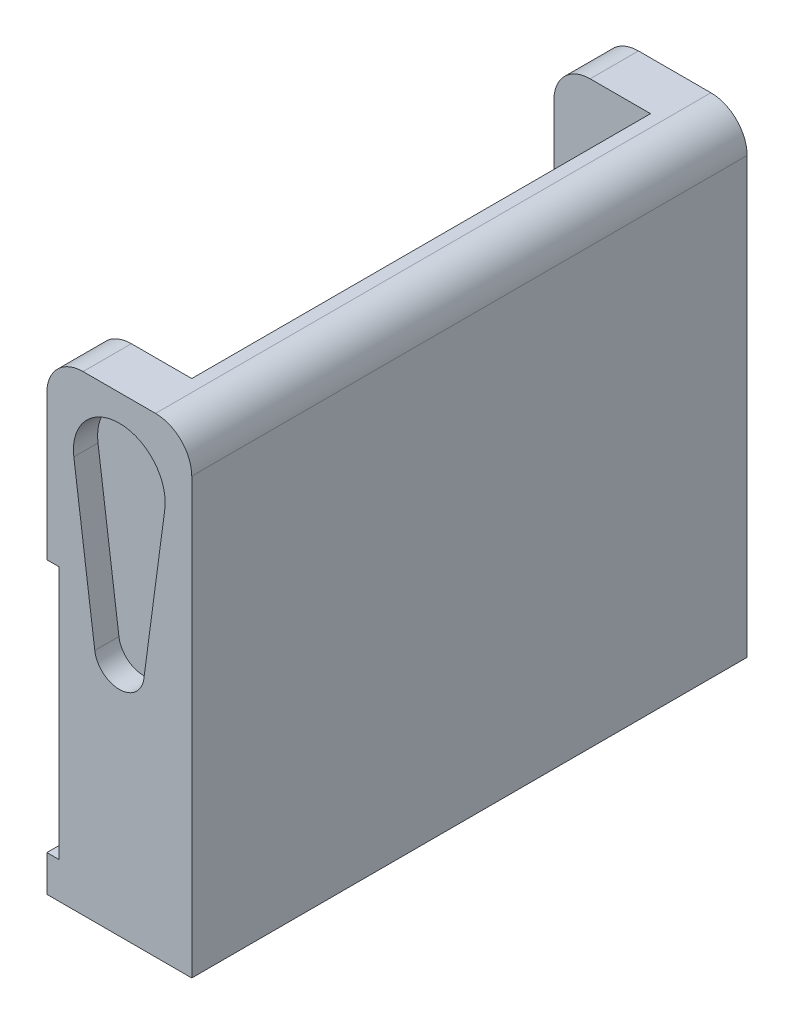
ISO-10303-21;
HEADER;
FILE_DESCRIPTION(('STEP AP214'),'2;1');
FILE_NAME('part.step','',(''),(''),'','','');
FILE_SCHEMA(('AUTOMOTIVE_DESIGN { 1 0 10303 214 1 1 1 1 }'));
ENDSEC;
DATA;
#1=APPLICATION_CONTEXT('core data for automotive mechanical design processes');
#2=APPLICATION_PROTOCOL_DEFINITION('international standard','automotive_design',2000,#1);
#3=PRODUCT_CONTEXT('',#1,'mechanical');
#4=PRODUCT('Part','Part','',(#3));
#5=PRODUCT_RELATED_PRODUCT_CATEGORY('part','',(#4));
#6=PRODUCT_DEFINITION_FORMATION('','',#4);
#7=PRODUCT_DEFINITION_CONTEXT('part definition',#1,'design');
#8=PRODUCT_DEFINITION('design','',#6,#7);
#9=PRODUCT_DEFINITION_SHAPE('','',#8);
#10=(LENGTH_UNIT() NAMED_UNIT(*) SI_UNIT(.MILLI.,.METRE.));
#11=(NAMED_UNIT(*) PLANE_ANGLE_UNIT() SI_UNIT($,.RADIAN.));
#12=(NAMED_UNIT(*) SI_UNIT($,.STERADIAN.) SOLID_ANGLE_UNIT());
#13=UNCERTAINTY_MEASURE_WITH_UNIT(LENGTH_MEASURE(1.E-05),#10,'distance_accuracy_value','');
#14=(GEOMETRIC_REPRESENTATION_CONTEXT(3) GLOBAL_UNCERTAINTY_ASSIGNED_CONTEXT((#13)) GLOBAL_UNIT_ASSIGNED_CONTEXT((#10,
#11,#12)) REPRESENTATION_CONTEXT('',''));
#15=CARTESIAN_POINT('',(0.,0.,0.));
#16=DIRECTION('',(0.,0.,1.));
#17=DIRECTION('',(1.,0.,0.));
#18=AXIS2_PLACEMENT_3D('',#15,#16,#17);
#19=CARTESIAN_POINT('',(-6.,-33.,-19.));
#20=DIRECTION('',(-1.,0.,0.));
#21=DIRECTION('',(0.,0.,1.));
#22=AXIS2_PLACEMENT_3D('',#19,#20,#21);
#23=PLANE('',#22);
#24=DIRECTION('',(0.,0.,-1.));
#25=VECTOR('',#24,1.);
#26=CARTESIAN_POINT('',(-6.,-9.,-23.));
#27=LINE('',#26,#25);
#28=CARTESIAN_POINT('',(-6.,-9.,-19.));
#29=VERTEX_POINT('',#28);
#30=CARTESIAN_POINT('',(-6.,-9.,-23.));
#31=VERTEX_POINT('',#30);
#32=EDGE_CURVE('E417',#29,#31,#27,.T.);
#33=ORIENTED_EDGE('',*,*,#32,.F.);
#34=DIRECTION('',(0.,1.,0.));
#35=VECTOR('',#34,1.);
#36=CARTESIAN_POINT('',(-6.,-33.,-19.));
#37=LINE('',#36,#35);
#38=CARTESIAN_POINT('',(-6.,3.,-19.));
#39=VERTEX_POINT('',#38);
#40=EDGE_CURVE('E336',#29,#39,#37,.T.);
#41=ORIENTED_EDGE('',*,*,#40,.T.);
#42=DIRECTION('',(0.,0.,1.));
#43=VECTOR('',#42,1.);
#44=CARTESIAN_POINT('',(-6.,3.,-23.));
#45=LINE('',#44,#43);
#46=CARTESIAN_POINT('',(-6.,3.,-23.));
#47=VERTEX_POINT('',#46);
#48=EDGE_CURVE('E385',#39,#47,#45,.F.);
#49=ORIENTED_EDGE('',*,*,#48,.T.);
#50=DIRECTION('',(0.,1.,0.));
#51=VECTOR('',#50,1.);
#52=CARTESIAN_POINT('',(-6.,-33.,-23.));
#53=LINE('',#52,#51);
#54=EDGE_CURVE('E351',#31,#47,#53,.T.);
#55=ORIENTED_EDGE('',*,*,#54,.F.);
#56=EDGE_LOOP('',(#33,#41,#49,#55));
#57=FACE_BOUND('',#56,.T.);
#58=ADVANCED_FACE('F33',(#57),#23,.T.);
#59=CARTESIAN_POINT('',(-6.,-33.,23.));
#60=DIRECTION('',(-1.,0.,0.));
#61=DIRECTION('',(0.,0.,1.));
#62=AXIS2_PLACEMENT_3D('',#59,#60,#61);
#63=PLANE('',#62);
#64=CARTESIAN_POINT('',(-6.,-9.,23.));
#65=VERTEX_POINT('',#64);
#66=CARTESIAN_POINT('',(-6.,-9.,19.));
#67=VERTEX_POINT('',#66);
#68=EDGE_CURVE('E226',#65,#67,#27,.T.);
#69=ORIENTED_EDGE('',*,*,#68,.F.);
#70=DIRECTION('',(0.,1.,0.));
#71=VECTOR('',#70,1.);
#72=CARTESIAN_POINT('',(-6.,-33.,23.));
#73=LINE('',#72,#71);
#74=CARTESIAN_POINT('',(-6.,3.,23.));
#75=VERTEX_POINT('',#74);
#76=EDGE_CURVE('E361',#65,#75,#73,.T.);
#77=ORIENTED_EDGE('',*,*,#76,.T.);
#78=DIRECTION('',(0.,0.,1.));
#79=VECTOR('',#78,1.);
#80=CARTESIAN_POINT('',(-6.,3.,19.));
#81=LINE('',#80,#79);
#82=CARTESIAN_POINT('',(-6.,3.,19.));
#83=VERTEX_POINT('',#82);
#84=EDGE_CURVE('E399',#75,#83,#81,.F.);
#85=ORIENTED_EDGE('',*,*,#84,.T.);
#86=DIRECTION('',(0.,1.,0.));
#87=VECTOR('',#86,1.);
#88=CARTESIAN_POINT('',(-6.,-33.,19.));
#89=LINE('',#88,#87);
#90=EDGE_CURVE('E365',#67,#83,#89,.T.);
#91=ORIENTED_EDGE('',*,*,#90,.F.);
#92=EDGE_LOOP('',(#69,#77,#85,#91));
#93=FACE_BOUND('',#92,.T.);
#94=ADVANCED_FACE('F433',(#93),#63,.T.);
#95=CARTESIAN_POINT('',(-6.,-33.,-23.));
#96=DIRECTION('',(0.,0.,-1.));
#97=DIRECTION('',(-1.,0.,0.));
#98=AXIS2_PLACEMENT_3D('',#95,#96,#97);
#99=PLANE('',#98);
#100=DIRECTION('',(-1.,0.,0.));
#101=VECTOR('',#100,1.);
#102=CARTESIAN_POINT('',(-5.,-9.,-23.));
#103=LINE('',#102,#101);
#104=CARTESIAN_POINT('',(-5.,-9.,-23.));
#105=VERTEX_POINT('',#104);
#106=EDGE_CURVE('E244',#105,#31,#103,.T.);
#107=ORIENTED_EDGE('',*,*,#106,.T.);
#108=ORIENTED_EDGE('',*,*,#54,.T.);
#109=CARTESIAN_POINT('',(-3.,3.,-23.));
#110=DIRECTION('',(0.,0.,-1.));
#111=DIRECTION('',(-1.,0.,0.));
#112=AXIS2_PLACEMENT_3D('',#109,#110,#111);
#113=CIRCLE('',#112,3.);
#114=CARTESIAN_POINT('',(-3.,6.,-23.));
#115=VERTEX_POINT('',#114);
#116=EDGE_CURVE('E390',#47,#115,#113,.T.);
#117=ORIENTED_EDGE('',*,*,#116,.T.);
#118=DIRECTION('',(-1.,0.,0.));
#119=VECTOR('',#118,1.);
#120=CARTESIAN_POINT('',(-6.,6.,-23.));
#121=LINE('',#120,#119);
#122=CARTESIAN_POINT('',(3.,6.,-23.));
#123=VERTEX_POINT('',#122);
#124=EDGE_CURVE('E316',#123,#115,#121,.T.);
#125=ORIENTED_EDGE('',*,*,#124,.F.);
#126=CARTESIAN_POINT('',(3.,3.,-23.));
#127=DIRECTION('',(0.,0.,-1.));
#128=DIRECTION('',(-1.,0.,0.));
#129=AXIS2_PLACEMENT_3D('',#126,#127,#128);
#130=CIRCLE('',#129,3.);
#131=CARTESIAN_POINT('',(6.,3.,-23.));
#132=VERTEX_POINT('',#131);
#133=EDGE_CURVE('E388',#123,#132,#130,.T.);
#134=ORIENTED_EDGE('',*,*,#133,.T.);
#135=DIRECTION('',(0.,1.,0.));
#136=VECTOR('',#135,1.);
#137=CARTESIAN_POINT('',(6.,-33.,-23.));
#138=LINE('',#137,#136);
#139=CARTESIAN_POINT('',(6.,-33.,-23.));
#140=VERTEX_POINT('',#139);
#141=EDGE_CURVE('E352',#140,#132,#138,.T.);
#142=ORIENTED_EDGE('',*,*,#141,.F.);
#143=DIRECTION('',(-1.,0.,0.));
#144=VECTOR('',#143,1.);
#145=CARTESIAN_POINT('',(-6.,-33.,-23.));
#146=LINE('',#145,#144);
#147=CARTESIAN_POINT('',(-6.,-33.,-23.));
#148=VERTEX_POINT('',#147);
#149=EDGE_CURVE('E334',#140,#148,#146,.T.);
#150=ORIENTED_EDGE('',*,*,#149,.T.);
#151=CARTESIAN_POINT('',(-6.,-30.,-23.));
#152=VERTEX_POINT('',#151);
#153=EDGE_CURVE('E232',#148,#152,#53,.T.);
#154=ORIENTED_EDGE('',*,*,#153,.T.);
#155=DIRECTION('',(-1.,0.,0.));
#156=VECTOR('',#155,1.);
#157=CARTESIAN_POINT('',(-5.,-30.,-23.));
#158=LINE('',#157,#156);
#159=CARTESIAN_POINT('',(-5.,-30.,-23.));
#160=VERTEX_POINT('',#159);
#161=EDGE_CURVE('E211',#160,#152,#158,.T.);
#162=ORIENTED_EDGE('',*,*,#161,.F.);
#163=DIRECTION('',(0.,-1.,0.));
#164=VECTOR('',#163,1.);
#165=CARTESIAN_POINT('',(-5.,-30.,-23.));
#166=LINE('',#165,#164);
#167=EDGE_CURVE('E219',#105,#160,#166,.T.);
#168=ORIENTED_EDGE('',*,*,#167,.F.);
#169=EDGE_LOOP('',(#107,#108,#117,#125,#134,#142,#150,#154,#162,#168));
#170=FACE_BOUND('',#169,.T.);
#171=DIRECTION('',(0.132075471698113,0.991239663136883,0.));
#172=VECTOR('',#171,1.);
#173=CARTESIAN_POINT('',(3.76671071992015,-0.501886792452829,-23.));
#174=LINE('',#173,#172);
#175=CARTESIAN_POINT('',(2.03204130943061,-13.5207547169811,-23.));
#176=VERTEX_POINT('',#175);
#177=CARTESIAN_POINT('',(3.76671071992015,-0.501886792452826,-23.));
#178=VERTEX_POINT('',#177);
#179=EDGE_CURVE('E262',#176,#178,#174,.T.);
#180=ORIENTED_EDGE('',*,*,#179,.T.);
#181=CARTESIAN_POINT('',(0.,0.,-23.));
#182=DIRECTION('',(0.,0.,1.));
#183=DIRECTION('',(1.,0.,0.));
#184=AXIS2_PLACEMENT_3D('',#181,#182,#183);
#185=CIRCLE('',#184,3.8);
#186=CARTESIAN_POINT('',(-3.76671071992015,-0.50188679245283,-23.));
#187=VERTEX_POINT('',#186);
#188=EDGE_CURVE('E248',#178,#187,#185,.T.);
#189=ORIENTED_EDGE('',*,*,#188,.T.);
#190=DIRECTION('',(0.132075471698113,-0.991239663136883,0.));
#191=VECTOR('',#190,1.);
#192=CARTESIAN_POINT('',(-3.76671071992015,-0.50188679245283,-23.));
#193=LINE('',#192,#191);
#194=CARTESIAN_POINT('',(-2.03204130943061,-13.5207547169811,-23.));
#195=VERTEX_POINT('',#194);
#196=EDGE_CURVE('E253',#187,#195,#193,.T.);
#197=ORIENTED_EDGE('',*,*,#196,.T.);
#198=CARTESIAN_POINT('',(0.,-13.25,-23.));
#199=DIRECTION('',(0.,0.,1.));
#200=DIRECTION('',(1.,0.,0.));
#201=AXIS2_PLACEMENT_3D('',#198,#199,#200);
#202=CIRCLE('',#201,2.05);
#203=EDGE_CURVE('E265',#195,#176,#202,.T.);
#204=ORIENTED_EDGE('',*,*,#203,.T.);
#205=EDGE_LOOP('',(#180,#189,#197,#204));
#206=FACE_BOUND('',#205,.T.);
#207=ADVANCED_FACE('F229',(#170,#206),#99,.T.);
#208=DIRECTION('',(0.,0.,1.));
#209=VECTOR('',#208,1.);
#210=CARTESIAN_POINT('',(-6.,-30.,-23.));
#211=LINE('',#210,#209);
#212=CARTESIAN_POINT('',(-6.,-30.,-19.));
#213=VERTEX_POINT('',#212);
#214=EDGE_CURVE('E418',#152,#213,#211,.T.);
#215=ORIENTED_EDGE('',*,*,#214,.F.);
#216=ORIENTED_EDGE('',*,*,#153,.F.);
#217=DIRECTION('',(0.,0.,1.));
#218=VECTOR('',#217,1.);
#219=CARTESIAN_POINT('',(-6.,-33.,-19.));
#220=LINE('',#219,#218);
#221=CARTESIAN_POINT('',(-6.,-33.,-19.));
#222=VERTEX_POINT('',#221);
#223=EDGE_CURVE('E312',#148,#222,#220,.T.);
#224=ORIENTED_EDGE('',*,*,#223,.T.);
#225=EDGE_CURVE('E371',#222,#213,#37,.T.);
#226=ORIENTED_EDGE('',*,*,#225,.T.);
#227=EDGE_LOOP('',(#215,#216,#224,#226));
#228=FACE_BOUND('',#227,.T.);
#229=ADVANCED_FACE('F481',(#228),#23,.T.);
#230=CARTESIAN_POINT('',(6.,-33.,-23.));
#231=DIRECTION('',(1.,0.,0.));
#232=DIRECTION('',(0.,0.,-1.));
#233=AXIS2_PLACEMENT_3D('',#230,#231,#232);
#234=PLANE('',#233);
#235=ORIENTED_EDGE('',*,*,#141,.T.);
#236=DIRECTION('',(0.,0.,-1.));
#237=VECTOR('',#236,1.);
#238=CARTESIAN_POINT('',(6.,3.,23.));
#239=LINE('',#238,#237);
#240=CARTESIAN_POINT('',(6.,3.,23.));
#241=VERTEX_POINT('',#240);
#242=EDGE_CURVE('E392',#132,#241,#239,.F.);
#243=ORIENTED_EDGE('',*,*,#242,.T.);
#244=DIRECTION('',(0.,1.,0.));
#245=VECTOR('',#244,1.);
#246=CARTESIAN_POINT('',(6.,-33.,23.));
#247=LINE('',#246,#245);
#248=CARTESIAN_POINT('',(6.,-33.,23.));
#249=VERTEX_POINT('',#248);
#250=EDGE_CURVE('E355',#249,#241,#247,.T.);
#251=ORIENTED_EDGE('',*,*,#250,.F.);
#252=DIRECTION('',(0.,0.,-1.));
#253=VECTOR('',#252,1.);
#254=CARTESIAN_POINT('',(6.,-33.,-23.));
#255=LINE('',#254,#253);
#256=EDGE_CURVE('E331',#249,#140,#255,.T.);
#257=ORIENTED_EDGE('',*,*,#256,.T.);
#258=EDGE_LOOP('',(#235,#243,#251,#257));
#259=FACE_BOUND('',#258,.T.);
#260=ADVANCED_FACE('F483',(#259),#234,.T.);
#261=CARTESIAN_POINT('',(6.,-33.,23.));
#262=DIRECTION('',(0.,0.,1.));
#263=DIRECTION('',(1.,0.,0.));
#264=AXIS2_PLACEMENT_3D('',#261,#262,#263);
#265=PLANE('',#264);
#266=DIRECTION('',(-1.,0.,0.));
#267=VECTOR('',#266,1.);
#268=CARTESIAN_POINT('',(-5.,-9.,23.));
#269=LINE('',#268,#267);
#270=CARTESIAN_POINT('',(-5.,-9.,23.));
#271=VERTEX_POINT('',#270);
#272=EDGE_CURVE('E236',#271,#65,#269,.T.);
#273=ORIENTED_EDGE('',*,*,#272,.F.);
#274=DIRECTION('',(0.,1.,0.));
#275=VECTOR('',#274,1.);
#276=CARTESIAN_POINT('',(-5.,-30.,23.));
#277=LINE('',#276,#275);
#278=CARTESIAN_POINT('',(-5.,-30.,23.));
#279=VERTEX_POINT('',#278);
#280=EDGE_CURVE('E215',#279,#271,#277,.T.);
#281=ORIENTED_EDGE('',*,*,#280,.F.);
#282=DIRECTION('',(-1.,0.,0.));
#283=VECTOR('',#282,1.);
#284=CARTESIAN_POINT('',(-5.,-30.,23.));
#285=LINE('',#284,#283);
#286=CARTESIAN_POINT('',(-6.,-30.,23.));
#287=VERTEX_POINT('',#286);
#288=EDGE_CURVE('E233',#279,#287,#285,.T.);
#289=ORIENTED_EDGE('',*,*,#288,.T.);
#290=CARTESIAN_POINT('',(-6.,-33.,23.));
#291=VERTEX_POINT('',#290);
#292=EDGE_CURVE('E358',#291,#287,#73,.T.);
#293=ORIENTED_EDGE('',*,*,#292,.F.);
#294=DIRECTION('',(1.,0.,0.));
#295=VECTOR('',#294,1.);
#296=CARTESIAN_POINT('',(6.,-33.,23.));
#297=LINE('',#296,#295);
#298=EDGE_CURVE('E328',#291,#249,#297,.T.);
#299=ORIENTED_EDGE('',*,*,#298,.T.);
#300=ORIENTED_EDGE('',*,*,#250,.T.);
#301=CARTESIAN_POINT('',(3.,3.,23.));
#302=DIRECTION('',(0.,0.,1.));
#303=DIRECTION('',(1.,0.,0.));
#304=AXIS2_PLACEMENT_3D('',#301,#302,#303);
#305=CIRCLE('',#304,3.);
#306=CARTESIAN_POINT('',(3.,6.,23.));
#307=VERTEX_POINT('',#306);
#308=EDGE_CURVE('E397',#241,#307,#305,.T.);
#309=ORIENTED_EDGE('',*,*,#308,.T.);
#310=DIRECTION('',(1.,0.,0.));
#311=VECTOR('',#310,1.);
#312=CARTESIAN_POINT('',(6.,6.,23.));
#313=LINE('',#312,#311);
#314=CARTESIAN_POINT('',(-3.,6.,23.));
#315=VERTEX_POINT('',#314);
#316=EDGE_CURVE('E344',#315,#307,#313,.T.);
#317=ORIENTED_EDGE('',*,*,#316,.F.);
#318=CARTESIAN_POINT('',(-3.,3.,23.));
#319=DIRECTION('',(0.,0.,1.));
#320=DIRECTION('',(1.,0.,0.));
#321=AXIS2_PLACEMENT_3D('',#318,#319,#320);
#322=CIRCLE('',#321,3.);
#323=EDGE_CURVE('E394',#315,#75,#322,.T.);
#324=ORIENTED_EDGE('',*,*,#323,.T.);
#325=ORIENTED_EDGE('',*,*,#76,.F.);
#326=EDGE_LOOP('',(#273,#281,#289,#293,#299,#300,#309,#317,#324,#325));
#327=FACE_BOUND('',#326,.T.);
#328=CARTESIAN_POINT('',(0.,0.,23.));
#329=DIRECTION('',(0.,0.,1.));
#330=DIRECTION('',(1.,0.,0.));
#331=AXIS2_PLACEMENT_3D('',#328,#329,#330);
#332=CIRCLE('',#331,3.8);
#333=CARTESIAN_POINT('',(3.76671071992015,-0.501886792452829,23.));
#334=VERTEX_POINT('',#333);
#335=CARTESIAN_POINT('',(-3.76671071992015,-0.501886792452826,23.));
#336=VERTEX_POINT('',#335);
#337=EDGE_CURVE('E273',#334,#336,#332,.T.);
#338=ORIENTED_EDGE('',*,*,#337,.F.);
#339=DIRECTION('',(0.132075471698113,0.991239663136883,0.));
#340=VECTOR('',#339,1.);
#341=CARTESIAN_POINT('',(3.76671071992015,-0.501886792452829,23.));
#342=LINE('',#341,#340);
#343=CARTESIAN_POINT('',(2.03204130943061,-13.5207547169811,23.));
#344=VERTEX_POINT('',#343);
#345=EDGE_CURVE('E284',#344,#334,#342,.T.);
#346=ORIENTED_EDGE('',*,*,#345,.F.);
#347=CARTESIAN_POINT('',(0.,-13.25,23.));
#348=DIRECTION('',(0.,0.,1.));
#349=DIRECTION('',(1.,0.,0.));
#350=AXIS2_PLACEMENT_3D('',#347,#348,#349);
#351=CIRCLE('',#350,2.05);
#352=CARTESIAN_POINT('',(-2.03204130943061,-13.5207547169811,23.));
#353=VERTEX_POINT('',#352);
#354=EDGE_CURVE('E298',#353,#344,#351,.T.);
#355=ORIENTED_EDGE('',*,*,#354,.F.);
#356=DIRECTION('',(0.132075471698113,-0.991239663136883,0.));
#357=VECTOR('',#356,1.);
#358=CARTESIAN_POINT('',(-3.76671071992015,-0.50188679245283,23.));
#359=LINE('',#358,#357);
#360=EDGE_CURVE('E295',#336,#353,#359,.T.);
#361=ORIENTED_EDGE('',*,*,#360,.F.);
#362=EDGE_LOOP('',(#338,#346,#355,#361));
#363=FACE_BOUND('',#362,.T.);
#364=ADVANCED_FACE('F434',(#327,#363),#265,.T.);
#365=CARTESIAN_POINT('',(-6.,-30.,19.));
#366=VERTEX_POINT('',#365);
#367=EDGE_CURVE('E420',#366,#287,#211,.T.);
#368=ORIENTED_EDGE('',*,*,#367,.F.);
#369=CARTESIAN_POINT('',(-6.,-33.,19.));
#370=VERTEX_POINT('',#369);
#371=EDGE_CURVE('E362',#370,#366,#89,.T.);
#372=ORIENTED_EDGE('',*,*,#371,.F.);
#373=DIRECTION('',(0.,0.,1.));
#374=VECTOR('',#373,1.);
#375=CARTESIAN_POINT('',(-6.,-33.,23.));
#376=LINE('',#375,#374);
#377=EDGE_CURVE('E325',#370,#291,#376,.T.);
#378=ORIENTED_EDGE('',*,*,#377,.T.);
#379=ORIENTED_EDGE('',*,*,#292,.T.);
#380=EDGE_LOOP('',(#368,#372,#378,#379));
#381=FACE_BOUND('',#380,.T.);
#382=ADVANCED_FACE('F460',(#381),#63,.T.);
#383=CARTESIAN_POINT('',(-6.,-33.,19.));
#384=DIRECTION('',(0.,0.,-1.));
#385=DIRECTION('',(-1.,0.,0.));
#386=AXIS2_PLACEMENT_3D('',#383,#384,#385);
#387=PLANE('',#386);
#388=DIRECTION('',(1.,0.,0.));
#389=VECTOR('',#388,1.);
#390=CARTESIAN_POINT('',(-6.,-9.,19.));
#391=LINE('',#390,#389);
#392=CARTESIAN_POINT('',(-5.,-9.,19.));
#393=VERTEX_POINT('',#392);
#394=EDGE_CURVE('E246',#67,#393,#391,.T.);
#395=ORIENTED_EDGE('',*,*,#394,.F.);
#396=ORIENTED_EDGE('',*,*,#90,.T.);
#397=CARTESIAN_POINT('',(-3.,3.,19.));
#398=DIRECTION('',(0.,0.,-1.));
#399=DIRECTION('',(-1.,0.,0.));
#400=AXIS2_PLACEMENT_3D('',#397,#398,#399);
#401=CIRCLE('',#400,3.);
#402=CARTESIAN_POINT('',(-3.,6.,19.));
#403=VERTEX_POINT('',#402);
#404=EDGE_CURVE('E402',#83,#403,#401,.T.);
#405=ORIENTED_EDGE('',*,*,#404,.T.);
#406=DIRECTION('',(-1.,0.,0.));
#407=VECTOR('',#406,1.);
#408=CARTESIAN_POINT('',(-6.,6.,19.));
#409=LINE('',#408,#407);
#410=CARTESIAN_POINT('',(2.00000000000001,6.,19.));
#411=VERTEX_POINT('',#410);
#412=EDGE_CURVE('E341',#411,#403,#409,.T.);
#413=ORIENTED_EDGE('',*,*,#412,.F.);
#414=DIRECTION('',(0.,1.,0.));
#415=VECTOR('',#414,1.);
#416=CARTESIAN_POINT('',(2.00000000000001,-33.,19.));
#417=LINE('',#416,#415);
#418=CARTESIAN_POINT('',(2.00000000000001,-33.,19.));
#419=VERTEX_POINT('',#418);
#420=EDGE_CURVE('E366',#419,#411,#417,.T.);
#421=ORIENTED_EDGE('',*,*,#420,.F.);
#422=DIRECTION('',(-1.,0.,0.));
#423=VECTOR('',#422,1.);
#424=CARTESIAN_POINT('',(-6.,-33.,19.));
#425=LINE('',#424,#423);
#426=EDGE_CURVE('E322',#419,#370,#425,.T.);
#427=ORIENTED_EDGE('',*,*,#426,.T.);
#428=ORIENTED_EDGE('',*,*,#371,.T.);
#429=DIRECTION('',(-1.,0.,0.));
#430=VECTOR('',#429,1.);
#431=CARTESIAN_POINT('',(-6.,-30.,19.));
#432=LINE('',#431,#430);
#433=CARTESIAN_POINT('',(-5.,-30.,19.));
#434=VERTEX_POINT('',#433);
#435=EDGE_CURVE('E243',#434,#366,#432,.T.);
#436=ORIENTED_EDGE('',*,*,#435,.F.);
#437=DIRECTION('',(0.,-1.,0.));
#438=VECTOR('',#437,1.);
#439=CARTESIAN_POINT('',(-5.,-33.,19.));
#440=LINE('',#439,#438);
#441=EDGE_CURVE('E241',#393,#434,#440,.T.);
#442=ORIENTED_EDGE('',*,*,#441,.F.);
#443=EDGE_LOOP('',(#395,#396,#405,#413,#421,#427,#428,#436,#442));
#444=FACE_BOUND('',#443,.T.);
#445=ADVANCED_FACE('F443',(#444),#387,.T.);
#446=CARTESIAN_POINT('',(2.00000000000001,-33.,-19.));
#447=DIRECTION('',(-1.,0.,0.));
#448=DIRECTION('',(0.,0.,1.));
#449=AXIS2_PLACEMENT_3D('',#446,#447,#448);
#450=PLANE('',#449);
#451=DIRECTION('',(0.,0.,1.));
#452=VECTOR('',#451,1.);
#453=CARTESIAN_POINT('',(2.00000000000001,6.,-19.));
#454=LINE('',#453,#452);
#455=CARTESIAN_POINT('',(2.00000000000001,6.,-19.));
#456=VERTEX_POINT('',#455);
#457=EDGE_CURVE('E338',#456,#411,#454,.T.);
#458=ORIENTED_EDGE('',*,*,#457,.F.);
#459=DIRECTION('',(0.,1.,0.));
#460=VECTOR('',#459,1.);
#461=CARTESIAN_POINT('',(2.00000000000001,-33.,-19.));
#462=LINE('',#461,#460);
#463=CARTESIAN_POINT('',(2.00000000000001,-33.,-19.));
#464=VERTEX_POINT('',#463);
#465=EDGE_CURVE('E368',#464,#456,#462,.T.);
#466=ORIENTED_EDGE('',*,*,#465,.F.);
#467=DIRECTION('',(0.,0.,1.));
#468=VECTOR('',#467,1.);
#469=CARTESIAN_POINT('',(2.00000000000001,-33.,-19.));
#470=LINE('',#469,#468);
#471=EDGE_CURVE('E319',#464,#419,#470,.T.);
#472=ORIENTED_EDGE('',*,*,#471,.T.);
#473=ORIENTED_EDGE('',*,*,#420,.T.);
#474=EDGE_LOOP('',(#458,#466,#472,#473));
#475=FACE_BOUND('',#474,.T.);
#476=ADVANCED_FACE('F448',(#475),#450,.T.);
#477=CARTESIAN_POINT('',(2.00000000000001,-33.,-19.));
#478=DIRECTION('',(0.,0.,1.));
#479=DIRECTION('',(1.,0.,0.));
#480=AXIS2_PLACEMENT_3D('',#477,#478,#479);
#481=PLANE('',#480);
#482=DIRECTION('',(-1.,0.,0.));
#483=VECTOR('',#482,1.);
#484=CARTESIAN_POINT('',(2.00000000000001,-9.,-19.));
#485=LINE('',#484,#483);
#486=CARTESIAN_POINT('',(-5.,-9.,-19.));
#487=VERTEX_POINT('',#486);
#488=EDGE_CURVE('E11',#487,#29,#485,.T.);
#489=ORIENTED_EDGE('',*,*,#488,.F.);
#490=DIRECTION('',(0.,1.,0.));
#491=VECTOR('',#490,1.);
#492=CARTESIAN_POINT('',(-5.,-33.,-19.));
#493=LINE('',#492,#491);
#494=CARTESIAN_POINT('',(-5.,-30.,-19.));
#495=VERTEX_POINT('',#494);
#496=EDGE_CURVE('E404',#495,#487,#493,.T.);
#497=ORIENTED_EDGE('',*,*,#496,.F.);
#498=DIRECTION('',(1.,0.,0.));
#499=VECTOR('',#498,1.);
#500=CARTESIAN_POINT('',(2.00000000000001,-30.,-19.));
#501=LINE('',#500,#499);
#502=EDGE_CURVE('E41',#213,#495,#501,.T.);
#503=ORIENTED_EDGE('',*,*,#502,.F.);
#504=ORIENTED_EDGE('',*,*,#225,.F.);
#505=DIRECTION('',(1.,0.,0.));
#506=VECTOR('',#505,1.);
#507=CARTESIAN_POINT('',(2.00000000000001,-33.,-19.));
#508=LINE('',#507,#506);
#509=EDGE_CURVE('E315',#222,#464,#508,.T.);
#510=ORIENTED_EDGE('',*,*,#509,.T.);
#511=ORIENTED_EDGE('',*,*,#465,.T.);
#512=DIRECTION('',(1.,0.,0.));
#513=VECTOR('',#512,1.);
#514=CARTESIAN_POINT('',(2.00000000000001,6.,-19.));
#515=LINE('',#514,#513);
#516=CARTESIAN_POINT('',(-3.,6.,-19.));
#517=VERTEX_POINT('',#516);
#518=EDGE_CURVE('E305',#517,#456,#515,.T.);
#519=ORIENTED_EDGE('',*,*,#518,.F.);
#520=CARTESIAN_POINT('',(-3.,3.,-19.));
#521=DIRECTION('',(0.,0.,1.));
#522=DIRECTION('',(1.,0.,0.));
#523=AXIS2_PLACEMENT_3D('',#520,#521,#522);
#524=CIRCLE('',#523,3.);
#525=EDGE_CURVE('E382',#517,#39,#524,.T.);
#526=ORIENTED_EDGE('',*,*,#525,.T.);
#527=ORIENTED_EDGE('',*,*,#40,.F.);
#528=EDGE_LOOP('',(#489,#497,#503,#504,#510,#511,#519,#526,#527));
#529=FACE_BOUND('',#528,.T.);
#530=ADVANCED_FACE('F411',(#529),#481,.T.);
#531=CARTESIAN_POINT('',(0.,-33.,0.));
#532=DIRECTION('',(0.,-1.,0.));
#533=DIRECTION('',(0.,0.,-1.));
#534=AXIS2_PLACEMENT_3D('',#531,#532,#533);
#535=PLANE('',#534);
#536=ORIENTED_EDGE('',*,*,#223,.F.);
#537=ORIENTED_EDGE('',*,*,#149,.F.);
#538=ORIENTED_EDGE('',*,*,#256,.F.);
#539=ORIENTED_EDGE('',*,*,#298,.F.);
#540=ORIENTED_EDGE('',*,*,#377,.F.);
#541=ORIENTED_EDGE('',*,*,#426,.F.);
#542=ORIENTED_EDGE('',*,*,#471,.F.);
#543=ORIENTED_EDGE('',*,*,#509,.F.);
#544=EDGE_LOOP('',(#536,#537,#538,#539,#540,#541,#542,#543));
#545=FACE_BOUND('',#544,.T.);
#546=ADVANCED_FACE('F454',(#545),#535,.T.);
#547=CARTESIAN_POINT('',(0.,6.,0.));
#548=DIRECTION('',(0.,-1.,0.));
#549=DIRECTION('',(0.,0.,-1.));
#550=AXIS2_PLACEMENT_3D('',#547,#548,#549);
#551=PLANE('',#550);
#552=ORIENTED_EDGE('',*,*,#124,.T.);
#553=DIRECTION('',(0.,0.,1.));
#554=VECTOR('',#553,1.);
#555=CARTESIAN_POINT('',(-3.,6.,-19.));
#556=LINE('',#555,#554);
#557=EDGE_CURVE('E379',#115,#517,#556,.T.);
#558=ORIENTED_EDGE('',*,*,#557,.T.);
#559=ORIENTED_EDGE('',*,*,#518,.T.);
#560=ORIENTED_EDGE('',*,*,#457,.T.);
#561=ORIENTED_EDGE('',*,*,#412,.T.);
#562=DIRECTION('',(0.,0.,1.));
#563=VECTOR('',#562,1.);
#564=CARTESIAN_POINT('',(-3.,6.,23.));
#565=LINE('',#564,#563);
#566=EDGE_CURVE('E350',#403,#315,#565,.T.);
#567=ORIENTED_EDGE('',*,*,#566,.T.);
#568=ORIENTED_EDGE('',*,*,#316,.T.);
#569=DIRECTION('',(0.,0.,-1.));
#570=VECTOR('',#569,1.);
#571=CARTESIAN_POINT('',(3.,6.,-23.));
#572=LINE('',#571,#570);
#573=EDGE_CURVE('E376',#307,#123,#572,.T.);
#574=ORIENTED_EDGE('',*,*,#573,.T.);
#575=EDGE_LOOP('',(#552,#558,#559,#560,#561,#567,#568,#574));
#576=FACE_BOUND('',#575,.T.);
#577=ADVANCED_FACE('F445',(#576),#551,.F.);
#578=CARTESIAN_POINT('',(0.,0.,21.));
#579=DIRECTION('',(0.,0.,1.));
#580=DIRECTION('',(1.,0.,0.));
#581=AXIS2_PLACEMENT_3D('',#578,#579,#580);
#582=CYLINDRICAL_SURFACE('',#581,3.8);
#583=ORIENTED_EDGE('',*,*,#337,.T.);
#584=DIRECTION('',(0.,0.,1.));
#585=VECTOR('',#584,1.);
#586=CARTESIAN_POINT('',(-3.76671071992015,-0.50188679245283,21.));
#587=LINE('',#586,#585);
#588=CARTESIAN_POINT('',(-3.76671071992015,-0.50188679245283,21.));
#589=VERTEX_POINT('',#588);
#590=EDGE_CURVE('E293',#589,#336,#587,.T.);
#591=ORIENTED_EDGE('',*,*,#590,.F.);
#592=CARTESIAN_POINT('',(0.,0.,21.));
#593=DIRECTION('',(0.,0.,1.));
#594=DIRECTION('',(1.,0.,0.));
#595=AXIS2_PLACEMENT_3D('',#592,#593,#594);
#596=CIRCLE('',#595,3.8);
#597=CARTESIAN_POINT('',(3.76671071992015,-0.501886792452829,21.));
#598=VERTEX_POINT('',#597);
#599=EDGE_CURVE('E280',#598,#589,#596,.T.);
#600=ORIENTED_EDGE('',*,*,#599,.F.);
#601=DIRECTION('',(0.,0.,1.));
#602=VECTOR('',#601,1.);
#603=CARTESIAN_POINT('',(3.76671071992015,-0.501886792452829,21.));
#604=LINE('',#603,#602);
#605=EDGE_CURVE('E303',#598,#334,#604,.T.);
#606=ORIENTED_EDGE('',*,*,#605,.T.);
#607=EDGE_LOOP('',(#583,#591,#600,#606));
#608=FACE_BOUND('',#607,.T.);
#609=ADVANCED_FACE('F512',(#608),#582,.F.);
#610=CARTESIAN_POINT('',(3.76671071992015,-0.501886792452829,21.));
#611=DIRECTION('',(0.991239663136883,-0.132075471698113,0.));
#612=DIRECTION('',(0.132075471698113,0.991239663136883,0.));
#613=AXIS2_PLACEMENT_3D('',#610,#611,#612);
#614=PLANE('',#613);
#615=ORIENTED_EDGE('',*,*,#345,.T.);
#616=ORIENTED_EDGE('',*,*,#605,.F.);
#617=DIRECTION('',(0.132075471698113,0.991239663136883,0.));
#618=VECTOR('',#617,1.);
#619=CARTESIAN_POINT('',(3.76671071992015,-0.501886792452829,21.));
#620=LINE('',#619,#618);
#621=CARTESIAN_POINT('',(2.03204130943061,-13.5207547169811,21.));
#622=VERTEX_POINT('',#621);
#623=EDGE_CURVE('E290',#622,#598,#620,.T.);
#624=ORIENTED_EDGE('',*,*,#623,.F.);
#625=DIRECTION('',(0.,0.,1.));
#626=VECTOR('',#625,1.);
#627=CARTESIAN_POINT('',(2.03204130943061,-13.5207547169811,21.));
#628=LINE('',#627,#626);
#629=EDGE_CURVE('E306',#622,#344,#628,.T.);
#630=ORIENTED_EDGE('',*,*,#629,.T.);
#631=EDGE_LOOP('',(#615,#616,#624,#630));
#632=FACE_BOUND('',#631,.T.);
#633=ADVANCED_FACE('F517',(#632),#614,.F.);
#634=CARTESIAN_POINT('',(0.,-13.25,21.));
#635=DIRECTION('',(0.,0.,1.));
#636=DIRECTION('',(1.,0.,0.));
#637=AXIS2_PLACEMENT_3D('',#634,#635,#636);
#638=CYLINDRICAL_SURFACE('',#637,2.05);
#639=ORIENTED_EDGE('',*,*,#354,.T.);
#640=ORIENTED_EDGE('',*,*,#629,.F.);
#641=CARTESIAN_POINT('',(0.,-13.25,21.));
#642=DIRECTION('',(0.,0.,1.));
#643=DIRECTION('',(1.,0.,0.));
#644=AXIS2_PLACEMENT_3D('',#641,#642,#643);
#645=CIRCLE('',#644,2.05);
#646=CARTESIAN_POINT('',(-2.03204130943061,-13.5207547169811,21.));
#647=VERTEX_POINT('',#646);
#648=EDGE_CURVE('E287',#647,#622,#645,.T.);
#649=ORIENTED_EDGE('',*,*,#648,.F.);
#650=DIRECTION('',(0.,0.,1.));
#651=VECTOR('',#650,1.);
#652=CARTESIAN_POINT('',(-2.03204130943061,-13.5207547169811,21.));
#653=LINE('',#652,#651);
#654=EDGE_CURVE('E308',#647,#353,#653,.T.);
#655=ORIENTED_EDGE('',*,*,#654,.T.);
#656=EDGE_LOOP('',(#639,#640,#649,#655));
#657=FACE_BOUND('',#656,.T.);
#658=ADVANCED_FACE('F523',(#657),#638,.F.);
#659=CARTESIAN_POINT('',(-3.76671071992015,-0.50188679245283,21.));
#660=DIRECTION('',(-0.991239663136883,-0.132075471698113,0.));
#661=DIRECTION('',(0.132075471698113,-0.991239663136883,0.));
#662=AXIS2_PLACEMENT_3D('',#659,#660,#661);
#663=PLANE('',#662);
#664=ORIENTED_EDGE('',*,*,#360,.T.);
#665=ORIENTED_EDGE('',*,*,#654,.F.);
#666=DIRECTION('',(0.132075471698113,-0.991239663136883,0.));
#667=VECTOR('',#666,1.);
#668=CARTESIAN_POINT('',(-3.76671071992015,-0.50188679245283,21.));
#669=LINE('',#668,#667);
#670=EDGE_CURVE('E283',#589,#647,#669,.T.);
#671=ORIENTED_EDGE('',*,*,#670,.F.);
#672=ORIENTED_EDGE('',*,*,#590,.T.);
#673=EDGE_LOOP('',(#664,#665,#671,#672));
#674=FACE_BOUND('',#673,.T.);
#675=ADVANCED_FACE('F519',(#674),#663,.F.);
#676=CARTESIAN_POINT('',(0.,0.,21.));
#677=DIRECTION('',(0.,0.,1.));
#678=DIRECTION('',(1.,0.,0.));
#679=AXIS2_PLACEMENT_3D('',#676,#677,#678);
#680=PLANE('',#679);
#681=ORIENTED_EDGE('',*,*,#599,.T.);
#682=ORIENTED_EDGE('',*,*,#670,.T.);
#683=ORIENTED_EDGE('',*,*,#648,.T.);
#684=ORIENTED_EDGE('',*,*,#623,.T.);
#685=EDGE_LOOP('',(#681,#682,#683,#684));
#686=FACE_BOUND('',#685,.T.);
#687=ADVANCED_FACE('F522',(#686),#680,.T.);
#688=CARTESIAN_POINT('',(0.,0.,-21.));
#689=DIRECTION('',(0.,0.,-1.));
#690=DIRECTION('',(-1.,0.,0.));
#691=AXIS2_PLACEMENT_3D('',#688,#689,#690);
#692=CYLINDRICAL_SURFACE('',#691,3.8);
#693=ORIENTED_EDGE('',*,*,#188,.F.);
#694=DIRECTION('',(0.,0.,-1.));
#695=VECTOR('',#694,1.);
#696=CARTESIAN_POINT('',(3.76671071992015,-0.501886792452829,-21.));
#697=LINE('',#696,#695);
#698=CARTESIAN_POINT('',(3.76671071992015,-0.501886792452829,-21.));
#699=VERTEX_POINT('',#698);
#700=EDGE_CURVE('E259',#699,#178,#697,.T.);
#701=ORIENTED_EDGE('',*,*,#700,.F.);
#702=CARTESIAN_POINT('',(0.,0.,-21.));
#703=DIRECTION('',(0.,0.,1.));
#704=DIRECTION('',(1.,0.,0.));
#705=AXIS2_PLACEMENT_3D('',#702,#703,#704);
#706=CIRCLE('',#705,3.8);
#707=CARTESIAN_POINT('',(-3.76671071992015,-0.50188679245283,-21.));
#708=VERTEX_POINT('',#707);
#709=EDGE_CURVE('E249',#699,#708,#706,.T.);
#710=ORIENTED_EDGE('',*,*,#709,.T.);
#711=DIRECTION('',(0.,0.,-1.));
#712=VECTOR('',#711,1.);
#713=CARTESIAN_POINT('',(-3.76671071992015,-0.50188679245283,-21.));
#714=LINE('',#713,#712);
#715=EDGE_CURVE('E270',#708,#187,#714,.T.);
#716=ORIENTED_EDGE('',*,*,#715,.T.);
#717=EDGE_LOOP('',(#693,#701,#710,#716));
#718=FACE_BOUND('',#717,.T.);
#719=ADVANCED_FACE('F533',(#718),#692,.F.);
#720=CARTESIAN_POINT('',(-3.76671071992015,-0.50188679245283,-21.));
#721=DIRECTION('',(0.991239663136883,0.132075471698113,0.));
#722=DIRECTION('',(-0.132075471698113,0.991239663136883,0.));
#723=AXIS2_PLACEMENT_3D('',#720,#721,#722);
#724=PLANE('',#723);
#725=ORIENTED_EDGE('',*,*,#196,.F.);
#726=ORIENTED_EDGE('',*,*,#715,.F.);
#727=DIRECTION('',(0.132075471698113,-0.991239663136883,0.));
#728=VECTOR('',#727,1.);
#729=CARTESIAN_POINT('',(-3.76671071992015,-0.50188679245283,-21.));
#730=LINE('',#729,#728);
#731=CARTESIAN_POINT('',(-2.03204130943061,-13.5207547169811,-21.));
#732=VERTEX_POINT('',#731);
#733=EDGE_CURVE('E257',#708,#732,#730,.T.);
#734=ORIENTED_EDGE('',*,*,#733,.T.);
#735=DIRECTION('',(0.,0.,-1.));
#736=VECTOR('',#735,1.);
#737=CARTESIAN_POINT('',(-2.03204130943061,-13.5207547169811,-21.));
#738=LINE('',#737,#736);
#739=EDGE_CURVE('E274',#732,#195,#738,.T.);
#740=ORIENTED_EDGE('',*,*,#739,.T.);
#741=EDGE_LOOP('',(#725,#726,#734,#740));
#742=FACE_BOUND('',#741,.T.);
#743=ADVANCED_FACE('F537',(#742),#724,.T.);
#744=CARTESIAN_POINT('',(0.,-13.25,-21.));
#745=DIRECTION('',(0.,0.,-1.));
#746=DIRECTION('',(-1.,0.,0.));
#747=AXIS2_PLACEMENT_3D('',#744,#745,#746);
#748=CYLINDRICAL_SURFACE('',#747,2.05);
#749=ORIENTED_EDGE('',*,*,#203,.F.);
#750=ORIENTED_EDGE('',*,*,#739,.F.);
#751=CARTESIAN_POINT('',(0.,-13.25,-21.));
#752=DIRECTION('',(0.,0.,1.));
#753=DIRECTION('',(1.,0.,0.));
#754=AXIS2_PLACEMENT_3D('',#751,#752,#753);
#755=CIRCLE('',#754,2.05);
#756=CARTESIAN_POINT('',(2.03204130943061,-13.5207547169811,-21.));
#757=VERTEX_POINT('',#756);
#758=EDGE_CURVE('E255',#732,#757,#755,.T.);
#759=ORIENTED_EDGE('',*,*,#758,.T.);
#760=DIRECTION('',(0.,0.,-1.));
#761=VECTOR('',#760,1.);
#762=CARTESIAN_POINT('',(2.03204130943061,-13.5207547169811,-21.));
#763=LINE('',#762,#761);
#764=EDGE_CURVE('E276',#757,#176,#763,.T.);
#765=ORIENTED_EDGE('',*,*,#764,.T.);
#766=EDGE_LOOP('',(#749,#750,#759,#765));
#767=FACE_BOUND('',#766,.T.);
#768=ADVANCED_FACE('F543',(#767),#748,.F.);
#769=CARTESIAN_POINT('',(3.76671071992015,-0.501886792452829,-21.));
#770=DIRECTION('',(-0.991239663136883,0.132075471698113,0.));
#771=DIRECTION('',(-0.132075471698113,-0.991239663136883,0.));
#772=AXIS2_PLACEMENT_3D('',#769,#770,#771);
#773=PLANE('',#772);
#774=ORIENTED_EDGE('',*,*,#179,.F.);
#775=ORIENTED_EDGE('',*,*,#764,.F.);
#776=DIRECTION('',(0.132075471698113,0.991239663136883,0.));
#777=VECTOR('',#776,1.);
#778=CARTESIAN_POINT('',(3.76671071992015,-0.501886792452829,-21.));
#779=LINE('',#778,#777);
#780=EDGE_CURVE('E252',#757,#699,#779,.T.);
#781=ORIENTED_EDGE('',*,*,#780,.T.);
#782=ORIENTED_EDGE('',*,*,#700,.T.);
#783=EDGE_LOOP('',(#774,#775,#781,#782));
#784=FACE_BOUND('',#783,.T.);
#785=ADVANCED_FACE('F539',(#784),#773,.T.);
#786=CARTESIAN_POINT('',(0.,0.,-21.));
#787=DIRECTION('',(0.,0.,-1.));
#788=DIRECTION('',(1.,0.,0.));
#789=AXIS2_PLACEMENT_3D('',#786,#787,#788);
#790=PLANE('',#789);
#791=ORIENTED_EDGE('',*,*,#709,.F.);
#792=ORIENTED_EDGE('',*,*,#780,.F.);
#793=ORIENTED_EDGE('',*,*,#758,.F.);
#794=ORIENTED_EDGE('',*,*,#733,.F.);
#795=EDGE_LOOP('',(#791,#792,#793,#794));
#796=FACE_BOUND('',#795,.T.);
#797=ADVANCED_FACE('F542',(#796),#790,.T.);
#798=CARTESIAN_POINT('',(-3.,3.,0.));
#799=DIRECTION('',(0.,0.,-1.));
#800=DIRECTION('',(-1.,0.,0.));
#801=AXIS2_PLACEMENT_3D('',#798,#799,#800);
#802=CYLINDRICAL_SURFACE('',#801,3.);
#803=ORIENTED_EDGE('',*,*,#116,.F.);
#804=ORIENTED_EDGE('',*,*,#48,.F.);
#805=ORIENTED_EDGE('',*,*,#525,.F.);
#806=ORIENTED_EDGE('',*,*,#557,.F.);
#807=EDGE_LOOP('',(#803,#804,#805,#806));
#808=FACE_BOUND('',#807,.T.);
#809=ADVANCED_FACE('F478',(#808),#802,.T.);
#810=CARTESIAN_POINT('',(3.,3.,0.));
#811=DIRECTION('',(0.,0.,1.));
#812=DIRECTION('',(1.,0.,0.));
#813=AXIS2_PLACEMENT_3D('',#810,#811,#812);
#814=CYLINDRICAL_SURFACE('',#813,3.);
#815=ORIENTED_EDGE('',*,*,#308,.F.);
#816=ORIENTED_EDGE('',*,*,#242,.F.);
#817=ORIENTED_EDGE('',*,*,#133,.F.);
#818=ORIENTED_EDGE('',*,*,#573,.F.);
#819=EDGE_LOOP('',(#815,#816,#817,#818));
#820=FACE_BOUND('',#819,.T.);
#821=ADVANCED_FACE('F474',(#820),#814,.T.);
#822=CARTESIAN_POINT('',(-3.,3.,0.));
#823=DIRECTION('',(0.,0.,-1.));
#824=DIRECTION('',(-1.,0.,0.));
#825=AXIS2_PLACEMENT_3D('',#822,#823,#824);
#826=CYLINDRICAL_SURFACE('',#825,3.);
#827=ORIENTED_EDGE('',*,*,#404,.F.);
#828=ORIENTED_EDGE('',*,*,#84,.F.);
#829=ORIENTED_EDGE('',*,*,#323,.F.);
#830=ORIENTED_EDGE('',*,*,#566,.F.);
#831=EDGE_LOOP('',(#827,#828,#829,#830));
#832=FACE_BOUND('',#831,.T.);
#833=ADVANCED_FACE('F35',(#832),#826,.T.);
#834=CARTESIAN_POINT('',(-5.,0.,0.));
#835=DIRECTION('',(1.,0.,0.));
#836=DIRECTION('',(0.,0.,-1.));
#837=AXIS2_PLACEMENT_3D('',#834,#835,#836);
#838=PLANE('',#837);
#839=ORIENTED_EDGE('',*,*,#496,.T.);
#840=DIRECTION('',(0.,0.,-1.));
#841=VECTOR('',#840,1.);
#842=CARTESIAN_POINT('',(-5.,-9.,-23.));
#843=LINE('',#842,#841);
#844=EDGE_CURVE('E222',#487,#105,#843,.T.);
#845=ORIENTED_EDGE('',*,*,#844,.T.);
#846=ORIENTED_EDGE('',*,*,#167,.T.);
#847=DIRECTION('',(0.,0.,1.));
#848=VECTOR('',#847,1.);
#849=CARTESIAN_POINT('',(-5.,-30.,-23.));
#850=LINE('',#849,#848);
#851=EDGE_CURVE('E56',#160,#495,#850,.T.);
#852=ORIENTED_EDGE('',*,*,#851,.T.);
#853=EDGE_LOOP('',(#839,#845,#846,#852));
#854=FACE_BOUND('',#853,.T.);
#855=ADVANCED_FACE('F220',(#854),#838,.F.);
#856=CARTESIAN_POINT('',(-5.,-30.,-23.));
#857=DIRECTION('',(0.,-1.,0.));
#858=DIRECTION('',(0.,0.,-1.));
#859=AXIS2_PLACEMENT_3D('',#856,#857,#858);
#860=PLANE('',#859);
#861=ORIENTED_EDGE('',*,*,#502,.T.);
#862=ORIENTED_EDGE('',*,*,#851,.F.);
#863=ORIENTED_EDGE('',*,*,#161,.T.);
#864=ORIENTED_EDGE('',*,*,#214,.T.);
#865=EDGE_LOOP('',(#861,#862,#863,#864));
#866=FACE_BOUND('',#865,.T.);
#867=ADVANCED_FACE('F209',(#866),#860,.F.);
#868=CARTESIAN_POINT('',(-5.,-9.,-23.));
#869=DIRECTION('',(0.,1.,0.));
#870=DIRECTION('',(0.,0.,1.));
#871=AXIS2_PLACEMENT_3D('',#868,#869,#870);
#872=PLANE('',#871);
#873=ORIENTED_EDGE('',*,*,#488,.T.);
#874=ORIENTED_EDGE('',*,*,#32,.T.);
#875=ORIENTED_EDGE('',*,*,#106,.F.);
#876=ORIENTED_EDGE('',*,*,#844,.F.);
#877=EDGE_LOOP('',(#873,#874,#875,#876));
#878=FACE_BOUND('',#877,.T.);
#879=ADVANCED_FACE('F408',(#878),#872,.F.);
#880=ORIENTED_EDGE('',*,*,#394,.T.);
#881=EDGE_CURVE('E48',#271,#393,#843,.T.);
#882=ORIENTED_EDGE('',*,*,#881,.F.);
#883=ORIENTED_EDGE('',*,*,#272,.T.);
#884=ORIENTED_EDGE('',*,*,#68,.T.);
#885=EDGE_LOOP('',(#880,#882,#883,#884));
#886=FACE_BOUND('',#885,.T.);
#887=ADVANCED_FACE('F426',(#886),#872,.F.);
#888=ORIENTED_EDGE('',*,*,#435,.T.);
#889=ORIENTED_EDGE('',*,*,#367,.T.);
#890=ORIENTED_EDGE('',*,*,#288,.F.);
#891=EDGE_CURVE('E216',#434,#279,#850,.T.);
#892=ORIENTED_EDGE('',*,*,#891,.F.);
#893=EDGE_LOOP('',(#888,#889,#890,#892));
#894=FACE_BOUND('',#893,.T.);
#895=ADVANCED_FACE('F465',(#894),#860,.F.);
#896=ORIENTED_EDGE('',*,*,#441,.T.);
#897=ORIENTED_EDGE('',*,*,#891,.T.);
#898=ORIENTED_EDGE('',*,*,#280,.T.);
#899=ORIENTED_EDGE('',*,*,#881,.T.);
#900=EDGE_LOOP('',(#896,#897,#898,#899));
#901=FACE_BOUND('',#900,.T.);
#902=ADVANCED_FACE('F468',(#901),#838,.F.);
#903=CLOSED_SHELL('',(#58,#94,#207,#229,#260,#364,#382,#445,#476,#530,#546,#577,#609,#633,#658,
#675,#687,#719,#743,#768,#785,#797,#809,#821,#833,#855,#867,#879,#887,#895,#902));
#904=MANIFOLD_SOLID_BREP('B2',#903);
#905=ADVANCED_BREP_SHAPE_REPRESENTATION('',(#18,#904),#14);
#906=SHAPE_DEFINITION_REPRESENTATION(#9,#905);
ENDSEC;
END-ISO-10303-21;
